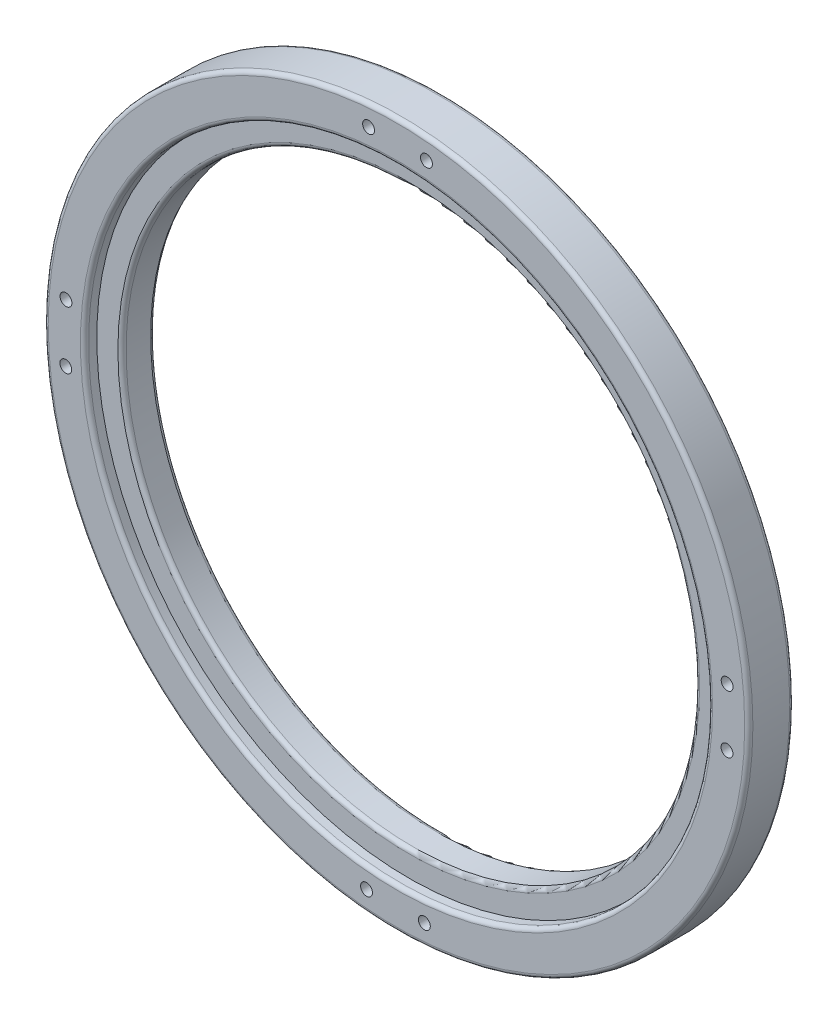
ISO-10303-21;
HEADER;
FILE_DESCRIPTION(('STEP AP214'),'2;1');
FILE_NAME('part.step','',(''),(''),'','','');
FILE_SCHEMA(('AUTOMOTIVE_DESIGN { 1 0 10303 214 1 1 1 1 }'));
ENDSEC;
DATA;
#1=APPLICATION_CONTEXT('core data for automotive mechanical design processes');
#2=APPLICATION_PROTOCOL_DEFINITION('international standard','automotive_design',2000,#1);
#3=PRODUCT_CONTEXT('',#1,'mechanical');
#4=PRODUCT('Part','Part','',(#3));
#5=PRODUCT_RELATED_PRODUCT_CATEGORY('part','',(#4));
#6=PRODUCT_DEFINITION_FORMATION('','',#4);
#7=PRODUCT_DEFINITION_CONTEXT('part definition',#1,'design');
#8=PRODUCT_DEFINITION('design','',#6,#7);
#9=PRODUCT_DEFINITION_SHAPE('','',#8);
#10=(LENGTH_UNIT() NAMED_UNIT(*) SI_UNIT(.MILLI.,.METRE.));
#11=(NAMED_UNIT(*) PLANE_ANGLE_UNIT() SI_UNIT($,.RADIAN.));
#12=(NAMED_UNIT(*) SI_UNIT($,.STERADIAN.) SOLID_ANGLE_UNIT());
#13=UNCERTAINTY_MEASURE_WITH_UNIT(LENGTH_MEASURE(1.E-05),#10,'distance_accuracy_value','');
#14=(GEOMETRIC_REPRESENTATION_CONTEXT(3) GLOBAL_UNCERTAINTY_ASSIGNED_CONTEXT((#13)) GLOBAL_UNIT_ASSIGNED_CONTEXT((#10,
#11,#12)) REPRESENTATION_CONTEXT('',''));
#15=CARTESIAN_POINT('',(0.,0.,0.));
#16=DIRECTION('',(0.,0.,1.));
#17=DIRECTION('',(1.,0.,0.));
#18=AXIS2_PLACEMENT_3D('',#15,#16,#17);
#19=CARTESIAN_POINT('',(0.,0.,8.));
#20=DIRECTION('',(0.,0.,1.));
#21=DIRECTION('',(1.,0.,0.));
#22=AXIS2_PLACEMENT_3D('',#19,#20,#21);
#23=PLANE('',#22);
#24=CARTESIAN_POINT('',(0.,0.,8.));
#25=DIRECTION('',(0.,0.,1.));
#26=DIRECTION('',(1.,0.,0.));
#27=AXIS2_PLACEMENT_3D('',#24,#25,#26);
#28=CIRCLE('',#27,71.);
#29=CARTESIAN_POINT('',(71.,0.,8.));
#30=VERTEX_POINT('',#29);
#31=EDGE_CURVE('E53',#30,#30,#28,.F.);
#32=ORIENTED_EDGE('',*,*,#31,.T.);
#33=EDGE_LOOP('',(#32));
#34=FACE_BOUND('',#33,.T.);
#35=CARTESIAN_POINT('',(0.,0.,8.));
#36=DIRECTION('',(0.,0.,1.));
#37=DIRECTION('',(1.,0.,0.));
#38=AXIS2_PLACEMENT_3D('',#35,#36,#37);
#39=CIRCLE('',#38,76.15);
#40=CARTESIAN_POINT('',(76.15,0.,8.));
#41=VERTEX_POINT('',#40);
#42=EDGE_CURVE('E93',#41,#41,#39,.T.);
#43=ORIENTED_EDGE('',*,*,#42,.T.);
#44=EDGE_LOOP('',(#43));
#45=FACE_BOUND('',#44,.T.);
#46=ADVANCED_FACE('F45',(#34,#45),#23,.T.);
#47=CARTESIAN_POINT('',(0.,0.,8.));
#48=DIRECTION('',(0.,0.,-1.));
#49=DIRECTION('',(-1.,0.,0.));
#50=AXIS2_PLACEMENT_3D('',#47,#48,#49);
#51=CYLINDRICAL_SURFACE('',#50,70.);
#52=CARTESIAN_POINT('',(0.,0.,1.));
#53=DIRECTION('',(0.,0.,1.));
#54=DIRECTION('',(1.,0.,0.));
#55=AXIS2_PLACEMENT_3D('',#52,#53,#54);
#56=CIRCLE('',#55,70.);
#57=CARTESIAN_POINT('',(70.,0.,1.));
#58=VERTEX_POINT('',#57);
#59=EDGE_CURVE('E77',#58,#58,#56,.F.);
#60=ORIENTED_EDGE('',*,*,#59,.T.);
#61=EDGE_LOOP('',(#60));
#62=FACE_BOUND('',#61,.T.);
#63=CARTESIAN_POINT('',(0.,0.,7.));
#64=DIRECTION('',(0.,0.,1.));
#65=DIRECTION('',(1.,0.,0.));
#66=AXIS2_PLACEMENT_3D('',#63,#64,#65);
#67=CIRCLE('',#66,70.);
#68=CARTESIAN_POINT('',(70.,0.,7.));
#69=VERTEX_POINT('',#68);
#70=EDGE_CURVE('E81',#69,#69,#67,.T.);
#71=ORIENTED_EDGE('',*,*,#70,.T.);
#72=EDGE_LOOP('',(#71));
#73=FACE_BOUND('',#72,.T.);
#74=ADVANCED_FACE('F229',(#62,#73),#51,.F.);
#75=CARTESIAN_POINT('',(0.,0.,8.));
#76=DIRECTION('',(0.,0.,-1.));
#77=DIRECTION('',(-1.,0.,0.));
#78=AXIS2_PLACEMENT_3D('',#75,#76,#77);
#79=CYLINDRICAL_SURFACE('',#78,86.);
#80=CARTESIAN_POINT('',(0.,0.,10.));
#81=DIRECTION('',(0.,0.,1.));
#82=DIRECTION('',(1.,0.,0.));
#83=AXIS2_PLACEMENT_3D('',#80,#81,#82);
#84=CIRCLE('',#83,86.);
#85=CARTESIAN_POINT('',(86.,0.,10.));
#86=VERTEX_POINT('',#85);
#87=EDGE_CURVE('E58',#86,#86,#84,.F.);
#88=ORIENTED_EDGE('',*,*,#87,.T.);
#89=EDGE_LOOP('',(#88));
#90=FACE_BOUND('',#89,.T.);
#91=CARTESIAN_POINT('',(0.,0.,1.));
#92=DIRECTION('',(0.,0.,1.));
#93=DIRECTION('',(1.,0.,0.));
#94=AXIS2_PLACEMENT_3D('',#91,#92,#93);
#95=CIRCLE('',#94,86.);
#96=CARTESIAN_POINT('',(86.,0.,1.));
#97=VERTEX_POINT('',#96);
#98=EDGE_CURVE('E63',#97,#97,#95,.T.);
#99=ORIENTED_EDGE('',*,*,#98,.T.);
#100=EDGE_LOOP('',(#99));
#101=FACE_BOUND('',#100,.T.);
#102=ADVANCED_FACE('F200',(#90,#101),#79,.T.);
#103=CARTESIAN_POINT('',(0.,0.,0.));
#104=DIRECTION('',(0.,0.,1.));
#105=DIRECTION('',(1.,0.,0.));
#106=AXIS2_PLACEMENT_3D('',#103,#104,#105);
#107=PLANE('',#106);
#108=CARTESIAN_POINT('',(-6.80811405362338,80.7133792071231,0.));
#109=DIRECTION('',(0.,0.,-1.));
#110=DIRECTION('',(-1.,0.,0.));
#111=AXIS2_PLACEMENT_3D('',#108,#109,#110);
#112=CIRCLE('',#111,1.475);
#113=CARTESIAN_POINT('',(-8.28311405362338,80.7133792071231,0.));
#114=VERTEX_POINT('',#113);
#115=EDGE_CURVE('E189',#114,#114,#112,.T.);
#116=ORIENTED_EDGE('',*,*,#115,.F.);
#117=EDGE_LOOP('',(#116));
#118=FACE_BOUND('',#117,.T.);
#119=CARTESIAN_POINT('',(7.31104770925723,80.6693782137495,0.));
#120=DIRECTION('',(0.,0.,-1.));
#121=DIRECTION('',(-1.,0.,0.));
#122=AXIS2_PLACEMENT_3D('',#119,#120,#121);
#123=CIRCLE('',#122,1.475);
#124=CARTESIAN_POINT('',(5.83604770925723,80.6693782137495,0.));
#125=VERTEX_POINT('',#124);
#126=EDGE_CURVE('E177',#125,#125,#123,.T.);
#127=ORIENTED_EDGE('',*,*,#126,.F.);
#128=EDGE_LOOP('',(#127));
#129=FACE_BOUND('',#128,.T.);
#130=CARTESIAN_POINT('',(-80.7133792071256,-6.80811405362128,0.));
#131=DIRECTION('',(0.,0.,-1.));
#132=DIRECTION('',(-1.,0.,0.));
#133=AXIS2_PLACEMENT_3D('',#130,#131,#132);
#134=CIRCLE('',#133,1.475);
#135=CARTESIAN_POINT('',(-82.1883792071256,-6.80811405362128,0.));
#136=VERTEX_POINT('',#135);
#137=EDGE_CURVE('E165',#136,#136,#134,.T.);
#138=ORIENTED_EDGE('',*,*,#137,.F.);
#139=EDGE_LOOP('',(#138));
#140=FACE_BOUND('',#139,.T.);
#141=CARTESIAN_POINT('',(-80.669378213752,7.3110477092593,0.));
#142=DIRECTION('',(0.,0.,-1.));
#143=DIRECTION('',(-1.,0.,0.));
#144=AXIS2_PLACEMENT_3D('',#141,#142,#143);
#145=CIRCLE('',#144,1.475);
#146=CARTESIAN_POINT('',(-82.144378213752,7.3110477092593,0.));
#147=VERTEX_POINT('',#146);
#148=EDGE_CURVE('E153',#147,#147,#145,.T.);
#149=ORIENTED_EDGE('',*,*,#148,.F.);
#150=EDGE_LOOP('',(#149));
#151=FACE_BOUND('',#150,.T.);
#152=CARTESIAN_POINT('',(6.8081140536188,-80.7133792071235,0.));
#153=DIRECTION('',(0.,0.,-1.));
#154=DIRECTION('',(-1.,0.,0.));
#155=AXIS2_PLACEMENT_3D('',#152,#153,#154);
#156=CIRCLE('',#155,1.475);
#157=CARTESIAN_POINT('',(5.3331140536188,-80.7133792071235,0.));
#158=VERTEX_POINT('',#157);
#159=EDGE_CURVE('E141',#158,#158,#156,.T.);
#160=ORIENTED_EDGE('',*,*,#159,.F.);
#161=EDGE_LOOP('',(#160));
#162=FACE_BOUND('',#161,.T.);
#163=CARTESIAN_POINT('',(-7.31104770926177,-80.6693782137499,0.));
#164=DIRECTION('',(0.,0.,-1.));
#165=DIRECTION('',(-1.,0.,0.));
#166=AXIS2_PLACEMENT_3D('',#163,#164,#165);
#167=CIRCLE('',#166,1.475);
#168=CARTESIAN_POINT('',(-8.78604770926177,-80.6693782137499,0.));
#169=VERTEX_POINT('',#168);
#170=EDGE_CURVE('E129',#169,#169,#167,.T.);
#171=ORIENTED_EDGE('',*,*,#170,.F.);
#172=EDGE_LOOP('',(#171));
#173=FACE_BOUND('',#172,.T.);
#174=CARTESIAN_POINT('',(80.7133792071211,6.80811405362087,0.));
#175=DIRECTION('',(0.,0.,-1.));
#176=DIRECTION('',(-1.,0.,0.));
#177=AXIS2_PLACEMENT_3D('',#174,#175,#176);
#178=CIRCLE('',#177,1.475);
#179=CARTESIAN_POINT('',(79.2383792071211,6.80811405362087,0.));
#180=VERTEX_POINT('',#179);
#181=EDGE_CURVE('E117',#180,#180,#178,.T.);
#182=ORIENTED_EDGE('',*,*,#181,.F.);
#183=EDGE_LOOP('',(#182));
#184=FACE_BOUND('',#183,.T.);
#185=CARTESIAN_POINT('',(80.6693782137475,-7.3110477092597,0.));
#186=DIRECTION('',(0.,0.,-1.));
#187=DIRECTION('',(-1.,0.,0.));
#188=AXIS2_PLACEMENT_3D('',#185,#186,#187);
#189=CIRCLE('',#188,1.475);
#190=CARTESIAN_POINT('',(79.1943782137475,-7.3110477092597,0.));
#191=VERTEX_POINT('',#190);
#192=EDGE_CURVE('E105',#191,#191,#189,.T.);
#193=ORIENTED_EDGE('',*,*,#192,.F.);
#194=EDGE_LOOP('',(#193));
#195=FACE_BOUND('',#194,.T.);
#196=CARTESIAN_POINT('',(0.,0.,0.));
#197=DIRECTION('',(0.,0.,1.));
#198=DIRECTION('',(1.,0.,0.));
#199=AXIS2_PLACEMENT_3D('',#196,#197,#198);
#200=CIRCLE('',#199,71.);
#201=CARTESIAN_POINT('',(71.,0.,0.));
#202=VERTEX_POINT('',#201);
#203=EDGE_CURVE('E85',#202,#202,#200,.T.);
#204=ORIENTED_EDGE('',*,*,#203,.T.);
#205=EDGE_LOOP('',(#204));
#206=FACE_BOUND('',#205,.T.);
#207=CARTESIAN_POINT('',(0.,0.,0.));
#208=DIRECTION('',(0.,0.,1.));
#209=DIRECTION('',(1.,0.,0.));
#210=AXIS2_PLACEMENT_3D('',#207,#208,#209);
#211=CIRCLE('',#210,85.);
#212=CARTESIAN_POINT('',(85.,0.,0.));
#213=VERTEX_POINT('',#212);
#214=EDGE_CURVE('E89',#213,#213,#211,.F.);
#215=ORIENTED_EDGE('',*,*,#214,.T.);
#216=EDGE_LOOP('',(#215));
#217=FACE_BOUND('',#216,.T.);
#218=ADVANCED_FACE('F196',(#118,#129,#140,#151,#162,#173,#184,#195,#206,#217),#107,.F.);
#219=CARTESIAN_POINT('',(0.,0.,11.));
#220=DIRECTION('',(0.,0.,1.));
#221=DIRECTION('',(1.,0.,0.));
#222=AXIS2_PLACEMENT_3D('',#219,#220,#221);
#223=PLANE('',#222);
#224=CARTESIAN_POINT('',(-6.80811405362338,80.7133792071231,11.));
#225=DIRECTION('',(0.,0.,-1.));
#226=DIRECTION('',(-1.,0.,0.));
#227=AXIS2_PLACEMENT_3D('',#224,#225,#226);
#228=CIRCLE('',#227,1.44999999999999);
#229=CARTESIAN_POINT('',(-8.25811405362338,80.7133792071231,11.));
#230=VERTEX_POINT('',#229);
#231=EDGE_CURVE('E181',#230,#230,#228,.T.);
#232=ORIENTED_EDGE('',*,*,#231,.T.);
#233=EDGE_LOOP('',(#232));
#234=FACE_BOUND('',#233,.T.);
#235=CARTESIAN_POINT('',(7.31104770925723,80.6693782137495,11.));
#236=DIRECTION('',(0.,0.,-1.));
#237=DIRECTION('',(-1.,0.,0.));
#238=AXIS2_PLACEMENT_3D('',#235,#236,#237);
#239=CIRCLE('',#238,1.44999999999999);
#240=CARTESIAN_POINT('',(5.86104770925724,80.6693782137495,11.));
#241=VERTEX_POINT('',#240);
#242=EDGE_CURVE('E169',#241,#241,#239,.T.);
#243=ORIENTED_EDGE('',*,*,#242,.T.);
#244=EDGE_LOOP('',(#243));
#245=FACE_BOUND('',#244,.T.);
#246=CARTESIAN_POINT('',(-80.7133792071256,-6.80811405362128,11.));
#247=DIRECTION('',(0.,0.,-1.));
#248=DIRECTION('',(-1.,0.,0.));
#249=AXIS2_PLACEMENT_3D('',#246,#247,#248);
#250=CIRCLE('',#249,1.44999999999999);
#251=CARTESIAN_POINT('',(-82.1633792071256,-6.80811405362128,11.));
#252=VERTEX_POINT('',#251);
#253=EDGE_CURVE('E157',#252,#252,#250,.T.);
#254=ORIENTED_EDGE('',*,*,#253,.T.);
#255=EDGE_LOOP('',(#254));
#256=FACE_BOUND('',#255,.T.);
#257=CARTESIAN_POINT('',(-80.669378213752,7.3110477092593,11.));
#258=DIRECTION('',(0.,0.,-1.));
#259=DIRECTION('',(-1.,0.,0.));
#260=AXIS2_PLACEMENT_3D('',#257,#258,#259);
#261=CIRCLE('',#260,1.44999999999999);
#262=CARTESIAN_POINT('',(-82.119378213752,7.3110477092593,11.));
#263=VERTEX_POINT('',#262);
#264=EDGE_CURVE('E145',#263,#263,#261,.T.);
#265=ORIENTED_EDGE('',*,*,#264,.T.);
#266=EDGE_LOOP('',(#265));
#267=FACE_BOUND('',#266,.T.);
#268=CARTESIAN_POINT('',(6.8081140536188,-80.7133792071235,11.));
#269=DIRECTION('',(0.,0.,-1.));
#270=DIRECTION('',(-1.,0.,0.));
#271=AXIS2_PLACEMENT_3D('',#268,#269,#270);
#272=CIRCLE('',#271,1.44999999999999);
#273=CARTESIAN_POINT('',(5.3581140536188,-80.7133792071235,11.));
#274=VERTEX_POINT('',#273);
#275=EDGE_CURVE('E133',#274,#274,#272,.T.);
#276=ORIENTED_EDGE('',*,*,#275,.T.);
#277=EDGE_LOOP('',(#276));
#278=FACE_BOUND('',#277,.T.);
#279=CARTESIAN_POINT('',(-7.31104770926177,-80.6693782137499,11.));
#280=DIRECTION('',(0.,0.,-1.));
#281=DIRECTION('',(-1.,0.,0.));
#282=AXIS2_PLACEMENT_3D('',#279,#280,#281);
#283=CIRCLE('',#282,1.44999999999999);
#284=CARTESIAN_POINT('',(-8.76104770926177,-80.6693782137499,11.));
#285=VERTEX_POINT('',#284);
#286=EDGE_CURVE('E121',#285,#285,#283,.T.);
#287=ORIENTED_EDGE('',*,*,#286,.T.);
#288=EDGE_LOOP('',(#287));
#289=FACE_BOUND('',#288,.T.);
#290=CARTESIAN_POINT('',(80.7133792071211,6.80811405362087,11.));
#291=DIRECTION('',(0.,0.,-1.));
#292=DIRECTION('',(-1.,0.,0.));
#293=AXIS2_PLACEMENT_3D('',#290,#291,#292);
#294=CIRCLE('',#293,1.44999999999999);
#295=CARTESIAN_POINT('',(79.2633792071211,6.80811405362087,11.));
#296=VERTEX_POINT('',#295);
#297=EDGE_CURVE('E109',#296,#296,#294,.T.);
#298=ORIENTED_EDGE('',*,*,#297,.T.);
#299=EDGE_LOOP('',(#298));
#300=FACE_BOUND('',#299,.T.);
#301=CARTESIAN_POINT('',(80.6693782137475,-7.3110477092597,11.));
#302=DIRECTION('',(0.,0.,-1.));
#303=DIRECTION('',(-1.,0.,0.));
#304=AXIS2_PLACEMENT_3D('',#301,#302,#303);
#305=CIRCLE('',#304,1.44999999999999);
#306=CARTESIAN_POINT('',(79.2193782137475,-7.3110477092597,11.));
#307=VERTEX_POINT('',#306);
#308=EDGE_CURVE('E97',#307,#307,#305,.T.);
#309=ORIENTED_EDGE('',*,*,#308,.T.);
#310=EDGE_LOOP('',(#309));
#311=FACE_BOUND('',#310,.T.);
#312=CARTESIAN_POINT('',(0.,0.,11.));
#313=DIRECTION('',(0.,0.,1.));
#314=DIRECTION('',(1.,0.,0.));
#315=AXIS2_PLACEMENT_3D('',#312,#313,#314);
#316=CIRCLE('',#315,85.);
#317=CARTESIAN_POINT('',(85.,0.,11.));
#318=VERTEX_POINT('',#317);
#319=EDGE_CURVE('E69',#318,#318,#316,.T.);
#320=ORIENTED_EDGE('',*,*,#319,.T.);
#321=EDGE_LOOP('',(#320));
#322=FACE_BOUND('',#321,.T.);
#323=CARTESIAN_POINT('',(0.,0.,11.));
#324=DIRECTION('',(0.,0.,1.));
#325=DIRECTION('',(1.,0.,0.));
#326=AXIS2_PLACEMENT_3D('',#323,#324,#325);
#327=CIRCLE('',#326,77.15);
#328=CARTESIAN_POINT('',(77.15,0.,11.));
#329=VERTEX_POINT('',#328);
#330=EDGE_CURVE('E73',#329,#329,#327,.F.);
#331=ORIENTED_EDGE('',*,*,#330,.T.);
#332=EDGE_LOOP('',(#331));
#333=FACE_BOUND('',#332,.T.);
#334=ADVANCED_FACE('F199',(#234,#245,#256,#267,#278,#289,#300,#311,#322,#333),#223,.T.);
#335=CARTESIAN_POINT('',(0.,0.,11.));
#336=DIRECTION('',(0.,0.,-1.));
#337=DIRECTION('',(-1.,0.,0.));
#338=AXIS2_PLACEMENT_3D('',#335,#336,#337);
#339=CYLINDRICAL_SURFACE('',#338,76.15);
#340=CARTESIAN_POINT('',(0.,0.,10.));
#341=DIRECTION('',(0.,0.,1.));
#342=DIRECTION('',(1.,0.,0.));
#343=AXIS2_PLACEMENT_3D('',#340,#341,#342);
#344=CIRCLE('',#343,76.15);
#345=CARTESIAN_POINT('',(76.15,0.,10.));
#346=VERTEX_POINT('',#345);
#347=EDGE_CURVE('E10',#346,#346,#344,.T.);
#348=ORIENTED_EDGE('',*,*,#347,.T.);
#349=EDGE_LOOP('',(#348));
#350=FACE_BOUND('',#349,.T.);
#351=ORIENTED_EDGE('',*,*,#42,.F.);
#352=EDGE_LOOP('',(#351));
#353=FACE_BOUND('',#352,.T.);
#354=ADVANCED_FACE('F246',(#350,#353),#339,.F.);
#355=CARTESIAN_POINT('',(0.,0.,1.));
#356=DIRECTION('',(0.,0.,1.));
#357=DIRECTION('',(1.,0.,0.));
#358=AXIS2_PLACEMENT_3D('',#355,#356,#357);
#359=TOROIDAL_SURFACE('',#358,71.,1.);
#360=ORIENTED_EDGE('',*,*,#59,.F.);
#361=EDGE_LOOP('',(#360));
#362=FACE_BOUND('',#361,.T.);
#363=ORIENTED_EDGE('',*,*,#203,.F.);
#364=EDGE_LOOP('',(#363));
#365=FACE_BOUND('',#364,.T.);
#366=ADVANCED_FACE('F249',(#362,#365),#359,.T.);
#367=CARTESIAN_POINT('',(0.,0.,10.));
#368=DIRECTION('',(0.,0.,1.));
#369=DIRECTION('',(1.,0.,0.));
#370=AXIS2_PLACEMENT_3D('',#367,#368,#369);
#371=TOROIDAL_SURFACE('',#370,85.,1.);
#372=ORIENTED_EDGE('',*,*,#87,.F.);
#373=EDGE_LOOP('',(#372));
#374=FACE_BOUND('',#373,.T.);
#375=ORIENTED_EDGE('',*,*,#319,.F.);
#376=EDGE_LOOP('',(#375));
#377=FACE_BOUND('',#376,.T.);
#378=ADVANCED_FACE('F224',(#374,#377),#371,.T.);
#379=CARTESIAN_POINT('',(0.,0.,1.));
#380=DIRECTION('',(0.,0.,1.));
#381=DIRECTION('',(1.,0.,0.));
#382=AXIS2_PLACEMENT_3D('',#379,#380,#381);
#383=TOROIDAL_SURFACE('',#382,85.,1.);
#384=ORIENTED_EDGE('',*,*,#214,.F.);
#385=EDGE_LOOP('',(#384));
#386=FACE_BOUND('',#385,.T.);
#387=ORIENTED_EDGE('',*,*,#98,.F.);
#388=EDGE_LOOP('',(#387));
#389=FACE_BOUND('',#388,.T.);
#390=ADVANCED_FACE('F220',(#386,#389),#383,.T.);
#391=CARTESIAN_POINT('',(0.,0.,7.));
#392=DIRECTION('',(0.,0.,1.));
#393=DIRECTION('',(1.,0.,0.));
#394=AXIS2_PLACEMENT_3D('',#391,#392,#393);
#395=TOROIDAL_SURFACE('',#394,71.,1.);
#396=ORIENTED_EDGE('',*,*,#31,.F.);
#397=EDGE_LOOP('',(#396));
#398=FACE_BOUND('',#397,.T.);
#399=ORIENTED_EDGE('',*,*,#70,.F.);
#400=EDGE_LOOP('',(#399));
#401=FACE_BOUND('',#400,.T.);
#402=ADVANCED_FACE('F223',(#398,#401),#395,.T.);
#403=CARTESIAN_POINT('',(0.,0.,10.));
#404=DIRECTION('',(0.,0.,1.));
#405=DIRECTION('',(1.,0.,0.));
#406=AXIS2_PLACEMENT_3D('',#403,#404,#405);
#407=TOROIDAL_SURFACE('',#406,77.15,1.);
#408=ORIENTED_EDGE('',*,*,#330,.F.);
#409=EDGE_LOOP('',(#408));
#410=FACE_BOUND('',#409,.T.);
#411=ORIENTED_EDGE('',*,*,#347,.F.);
#412=EDGE_LOOP('',(#411));
#413=FACE_BOUND('',#412,.T.);
#414=ADVANCED_FACE('F47',(#410,#413),#407,.T.);
#415=CARTESIAN_POINT('',(80.6693782137475,-7.3110477092597,0.));
#416=DIRECTION('',(0.,0.,-1.));
#417=DIRECTION('',(-1.,0.,0.));
#418=AXIS2_PLACEMENT_3D('',#415,#416,#417);
#419=CYLINDRICAL_SURFACE('',#418,1.44999999999999);
#420=ORIENTED_EDGE('',*,*,#308,.F.);
#421=EDGE_LOOP('',(#420));
#422=FACE_BOUND('',#421,.T.);
#423=CARTESIAN_POINT('',(80.6693782137475,-7.3110477092597,0.0250000000000042));
#424=DIRECTION('',(0.,0.,-1.));
#425=DIRECTION('',(-1.,0.,0.));
#426=AXIS2_PLACEMENT_3D('',#423,#424,#425);
#427=CIRCLE('',#426,1.44999999999999);
#428=CARTESIAN_POINT('',(79.2193782137475,-7.3110477092597,0.0250000000000042));
#429=VERTEX_POINT('',#428);
#430=EDGE_CURVE('E101',#429,#429,#427,.T.);
#431=ORIENTED_EDGE('',*,*,#430,.T.);
#432=EDGE_LOOP('',(#431));
#433=FACE_BOUND('',#432,.T.);
#434=ADVANCED_FACE('F250',(#422,#433),#419,.F.);
#435=CARTESIAN_POINT('',(80.6693782137475,-7.3110477092597,0.));
#436=DIRECTION('',(0.,0.,-1.));
#437=DIRECTION('',(-1.,0.,0.));
#438=AXIS2_PLACEMENT_3D('',#435,#436,#437);
#439=CONICAL_SURFACE('',#438,1.475,0.785398163397587);
#440=ORIENTED_EDGE('',*,*,#430,.F.);
#441=EDGE_LOOP('',(#440));
#442=FACE_BOUND('',#441,.T.);
#443=ORIENTED_EDGE('',*,*,#192,.T.);
#444=EDGE_LOOP('',(#443));
#445=FACE_BOUND('',#444,.T.);
#446=ADVANCED_FACE('F253',(#442,#445),#439,.F.);
#447=CARTESIAN_POINT('',(80.7133792071211,6.80811405362087,0.));
#448=DIRECTION('',(0.,0.,-1.));
#449=DIRECTION('',(-1.,0.,0.));
#450=AXIS2_PLACEMENT_3D('',#447,#448,#449);
#451=CYLINDRICAL_SURFACE('',#450,1.44999999999999);
#452=ORIENTED_EDGE('',*,*,#297,.F.);
#453=EDGE_LOOP('',(#452));
#454=FACE_BOUND('',#453,.T.);
#455=CARTESIAN_POINT('',(80.7133792071211,6.80811405362087,0.0250000000000042));
#456=DIRECTION('',(0.,0.,-1.));
#457=DIRECTION('',(-1.,0.,0.));
#458=AXIS2_PLACEMENT_3D('',#455,#456,#457);
#459=CIRCLE('',#458,1.44999999999999);
#460=CARTESIAN_POINT('',(79.2633792071211,6.80811405362087,0.0250000000000042));
#461=VERTEX_POINT('',#460);
#462=EDGE_CURVE('E113',#461,#461,#459,.T.);
#463=ORIENTED_EDGE('',*,*,#462,.T.);
#464=EDGE_LOOP('',(#463));
#465=FACE_BOUND('',#464,.T.);
#466=ADVANCED_FACE('F257',(#454,#465),#451,.F.);
#467=CARTESIAN_POINT('',(80.7133792071211,6.80811405362087,0.));
#468=DIRECTION('',(0.,0.,-1.));
#469=DIRECTION('',(-1.,0.,0.));
#470=AXIS2_PLACEMENT_3D('',#467,#468,#469);
#471=CONICAL_SURFACE('',#470,1.475,0.785398163397587);
#472=ORIENTED_EDGE('',*,*,#462,.F.);
#473=EDGE_LOOP('',(#472));
#474=FACE_BOUND('',#473,.T.);
#475=ORIENTED_EDGE('',*,*,#181,.T.);
#476=EDGE_LOOP('',(#475));
#477=FACE_BOUND('',#476,.T.);
#478=ADVANCED_FACE('F261',(#474,#477),#471,.F.);
#479=CARTESIAN_POINT('',(-7.31104770926177,-80.6693782137499,0.));
#480=DIRECTION('',(0.,0.,-1.));
#481=DIRECTION('',(-1.,0.,0.));
#482=AXIS2_PLACEMENT_3D('',#479,#480,#481);
#483=CYLINDRICAL_SURFACE('',#482,1.44999999999999);
#484=ORIENTED_EDGE('',*,*,#286,.F.);
#485=EDGE_LOOP('',(#484));
#486=FACE_BOUND('',#485,.T.);
#487=CARTESIAN_POINT('',(-7.31104770926177,-80.6693782137499,0.0250000000000042));
#488=DIRECTION('',(0.,0.,-1.));
#489=DIRECTION('',(-1.,0.,0.));
#490=AXIS2_PLACEMENT_3D('',#487,#488,#489);
#491=CIRCLE('',#490,1.45);
#492=CARTESIAN_POINT('',(-8.76104770926177,-80.6693782137499,0.0250000000000042));
#493=VERTEX_POINT('',#492);
#494=EDGE_CURVE('E125',#493,#493,#491,.T.);
#495=ORIENTED_EDGE('',*,*,#494,.T.);
#496=EDGE_LOOP('',(#495));
#497=FACE_BOUND('',#496,.T.);
#498=ADVANCED_FACE('F265',(#486,#497),#483,.F.);
#499=CARTESIAN_POINT('',(-7.31104770926177,-80.6693782137499,0.));
#500=DIRECTION('',(0.,0.,-1.));
#501=DIRECTION('',(-1.,0.,0.));
#502=AXIS2_PLACEMENT_3D('',#499,#500,#501);
#503=CONICAL_SURFACE('',#502,1.475,0.785398163397466);
#504=ORIENTED_EDGE('',*,*,#494,.F.);
#505=EDGE_LOOP('',(#504));
#506=FACE_BOUND('',#505,.T.);
#507=ORIENTED_EDGE('',*,*,#170,.T.);
#508=EDGE_LOOP('',(#507));
#509=FACE_BOUND('',#508,.T.);
#510=ADVANCED_FACE('F269',(#506,#509),#503,.F.);
#511=CARTESIAN_POINT('',(6.8081140536188,-80.7133792071235,0.));
#512=DIRECTION('',(0.,0.,-1.));
#513=DIRECTION('',(-1.,0.,0.));
#514=AXIS2_PLACEMENT_3D('',#511,#512,#513);
#515=CYLINDRICAL_SURFACE('',#514,1.44999999999999);
#516=ORIENTED_EDGE('',*,*,#275,.F.);
#517=EDGE_LOOP('',(#516));
#518=FACE_BOUND('',#517,.T.);
#519=CARTESIAN_POINT('',(6.8081140536188,-80.7133792071235,0.0250000000000042));
#520=DIRECTION('',(0.,0.,-1.));
#521=DIRECTION('',(-1.,0.,0.));
#522=AXIS2_PLACEMENT_3D('',#519,#520,#521);
#523=CIRCLE('',#522,1.45);
#524=CARTESIAN_POINT('',(5.3581140536188,-80.7133792071235,0.0250000000000042));
#525=VERTEX_POINT('',#524);
#526=EDGE_CURVE('E137',#525,#525,#523,.T.);
#527=ORIENTED_EDGE('',*,*,#526,.T.);
#528=EDGE_LOOP('',(#527));
#529=FACE_BOUND('',#528,.T.);
#530=ADVANCED_FACE('F273',(#518,#529),#515,.F.);
#531=CARTESIAN_POINT('',(6.8081140536188,-80.7133792071235,0.));
#532=DIRECTION('',(0.,0.,-1.));
#533=DIRECTION('',(-1.,0.,0.));
#534=AXIS2_PLACEMENT_3D('',#531,#532,#533);
#535=CONICAL_SURFACE('',#534,1.475,0.785398163397448);
#536=ORIENTED_EDGE('',*,*,#526,.F.);
#537=EDGE_LOOP('',(#536));
#538=FACE_BOUND('',#537,.T.);
#539=ORIENTED_EDGE('',*,*,#159,.T.);
#540=EDGE_LOOP('',(#539));
#541=FACE_BOUND('',#540,.T.);
#542=ADVANCED_FACE('F277',(#538,#541),#535,.F.);
#543=CARTESIAN_POINT('',(-80.669378213752,7.3110477092593,0.));
#544=DIRECTION('',(0.,0.,-1.));
#545=DIRECTION('',(-1.,0.,0.));
#546=AXIS2_PLACEMENT_3D('',#543,#544,#545);
#547=CYLINDRICAL_SURFACE('',#546,1.44999999999999);
#548=ORIENTED_EDGE('',*,*,#264,.F.);
#549=EDGE_LOOP('',(#548));
#550=FACE_BOUND('',#549,.T.);
#551=CARTESIAN_POINT('',(-80.669378213752,7.3110477092593,0.0250000000000042));
#552=DIRECTION('',(0.,0.,-1.));
#553=DIRECTION('',(-1.,0.,0.));
#554=AXIS2_PLACEMENT_3D('',#551,#552,#553);
#555=CIRCLE('',#554,1.44999999999999);
#556=CARTESIAN_POINT('',(-82.119378213752,7.3110477092593,0.0250000000000042));
#557=VERTEX_POINT('',#556);
#558=EDGE_CURVE('E149',#557,#557,#555,.T.);
#559=ORIENTED_EDGE('',*,*,#558,.T.);
#560=EDGE_LOOP('',(#559));
#561=FACE_BOUND('',#560,.T.);
#562=ADVANCED_FACE('F281',(#550,#561),#547,.F.);
#563=CARTESIAN_POINT('',(-80.669378213752,7.3110477092593,0.));
#564=DIRECTION('',(0.,0.,-1.));
#565=DIRECTION('',(-1.,0.,0.));
#566=AXIS2_PLACEMENT_3D('',#563,#564,#565);
#567=CONICAL_SURFACE('',#566,1.475,0.785398163397587);
#568=ORIENTED_EDGE('',*,*,#558,.F.);
#569=EDGE_LOOP('',(#568));
#570=FACE_BOUND('',#569,.T.);
#571=ORIENTED_EDGE('',*,*,#148,.T.);
#572=EDGE_LOOP('',(#571));
#573=FACE_BOUND('',#572,.T.);
#574=ADVANCED_FACE('F285',(#570,#573),#567,.F.);
#575=CARTESIAN_POINT('',(-80.7133792071256,-6.80811405362128,0.));
#576=DIRECTION('',(0.,0.,-1.));
#577=DIRECTION('',(-1.,0.,0.));
#578=AXIS2_PLACEMENT_3D('',#575,#576,#577);
#579=CYLINDRICAL_SURFACE('',#578,1.44999999999999);
#580=ORIENTED_EDGE('',*,*,#253,.F.);
#581=EDGE_LOOP('',(#580));
#582=FACE_BOUND('',#581,.T.);
#583=CARTESIAN_POINT('',(-80.7133792071256,-6.80811405362128,0.0250000000000042));
#584=DIRECTION('',(0.,0.,-1.));
#585=DIRECTION('',(-1.,0.,0.));
#586=AXIS2_PLACEMENT_3D('',#583,#584,#585);
#587=CIRCLE('',#586,1.44999999999999);
#588=CARTESIAN_POINT('',(-82.1633792071256,-6.80811405362128,0.0250000000000042));
#589=VERTEX_POINT('',#588);
#590=EDGE_CURVE('E161',#589,#589,#587,.T.);
#591=ORIENTED_EDGE('',*,*,#590,.T.);
#592=EDGE_LOOP('',(#591));
#593=FACE_BOUND('',#592,.T.);
#594=ADVANCED_FACE('F289',(#582,#593),#579,.F.);
#595=CARTESIAN_POINT('',(-80.7133792071256,-6.80811405362128,0.));
#596=DIRECTION('',(0.,0.,-1.));
#597=DIRECTION('',(-1.,0.,0.));
#598=AXIS2_PLACEMENT_3D('',#595,#596,#597);
#599=CONICAL_SURFACE('',#598,1.475,0.785398163397587);
#600=ORIENTED_EDGE('',*,*,#590,.F.);
#601=EDGE_LOOP('',(#600));
#602=FACE_BOUND('',#601,.T.);
#603=ORIENTED_EDGE('',*,*,#137,.T.);
#604=EDGE_LOOP('',(#603));
#605=FACE_BOUND('',#604,.T.);
#606=ADVANCED_FACE('F293',(#602,#605),#599,.F.);
#607=CARTESIAN_POINT('',(7.31104770925723,80.6693782137495,0.));
#608=DIRECTION('',(0.,0.,-1.));
#609=DIRECTION('',(-1.,0.,0.));
#610=AXIS2_PLACEMENT_3D('',#607,#608,#609);
#611=CYLINDRICAL_SURFACE('',#610,1.44999999999999);
#612=ORIENTED_EDGE('',*,*,#242,.F.);
#613=EDGE_LOOP('',(#612));
#614=FACE_BOUND('',#613,.T.);
#615=CARTESIAN_POINT('',(7.31104770925723,80.6693782137495,0.0250000000000042));
#616=DIRECTION('',(0.,0.,-1.));
#617=DIRECTION('',(-1.,0.,0.));
#618=AXIS2_PLACEMENT_3D('',#615,#616,#617);
#619=CIRCLE('',#618,1.45);
#620=CARTESIAN_POINT('',(5.86104770925724,80.6693782137495,0.0250000000000042));
#621=VERTEX_POINT('',#620);
#622=EDGE_CURVE('E173',#621,#621,#619,.T.);
#623=ORIENTED_EDGE('',*,*,#622,.T.);
#624=EDGE_LOOP('',(#623));
#625=FACE_BOUND('',#624,.T.);
#626=ADVANCED_FACE('F297',(#614,#625),#611,.F.);
#627=CARTESIAN_POINT('',(7.31104770925723,80.6693782137495,0.));
#628=DIRECTION('',(0.,0.,-1.));
#629=DIRECTION('',(-1.,0.,0.));
#630=AXIS2_PLACEMENT_3D('',#627,#628,#629);
#631=CONICAL_SURFACE('',#630,1.475,0.785398163397448);
#632=ORIENTED_EDGE('',*,*,#622,.F.);
#633=EDGE_LOOP('',(#632));
#634=FACE_BOUND('',#633,.T.);
#635=ORIENTED_EDGE('',*,*,#126,.T.);
#636=EDGE_LOOP('',(#635));
#637=FACE_BOUND('',#636,.T.);
#638=ADVANCED_FACE('F301',(#634,#637),#631,.F.);
#639=CARTESIAN_POINT('',(-6.80811405362338,80.7133792071231,0.));
#640=DIRECTION('',(0.,0.,-1.));
#641=DIRECTION('',(-1.,0.,0.));
#642=AXIS2_PLACEMENT_3D('',#639,#640,#641);
#643=CYLINDRICAL_SURFACE('',#642,1.44999999999999);
#644=ORIENTED_EDGE('',*,*,#231,.F.);
#645=EDGE_LOOP('',(#644));
#646=FACE_BOUND('',#645,.T.);
#647=CARTESIAN_POINT('',(-6.80811405362338,80.7133792071231,0.0250000000000042));
#648=DIRECTION('',(0.,0.,-1.));
#649=DIRECTION('',(-1.,0.,0.));
#650=AXIS2_PLACEMENT_3D('',#647,#648,#649);
#651=CIRCLE('',#650,1.45);
#652=CARTESIAN_POINT('',(-8.25811405362338,80.7133792071231,0.0250000000000042));
#653=VERTEX_POINT('',#652);
#654=EDGE_CURVE('E185',#653,#653,#651,.T.);
#655=ORIENTED_EDGE('',*,*,#654,.T.);
#656=EDGE_LOOP('',(#655));
#657=FACE_BOUND('',#656,.T.);
#658=ADVANCED_FACE('F305',(#646,#657),#643,.F.);
#659=CARTESIAN_POINT('',(-6.80811405362338,80.7133792071231,0.));
#660=DIRECTION('',(0.,0.,-1.));
#661=DIRECTION('',(-1.,0.,0.));
#662=AXIS2_PLACEMENT_3D('',#659,#660,#661);
#663=CONICAL_SURFACE('',#662,1.475,0.785398163397448);
#664=ORIENTED_EDGE('',*,*,#654,.F.);
#665=EDGE_LOOP('',(#664));
#666=FACE_BOUND('',#665,.T.);
#667=ORIENTED_EDGE('',*,*,#115,.T.);
#668=EDGE_LOOP('',(#667));
#669=FACE_BOUND('',#668,.T.);
#670=ADVANCED_FACE('F194',(#666,#669),#663,.F.);
#671=CLOSED_SHELL('',(#46,#74,#102,#218,#334,#354,#366,#378,#390,#402,#414,#434,#446,#466,#478,
#498,#510,#530,#542,#562,#574,#594,#606,#626,#638,#658,#670));
#672=MANIFOLD_SOLID_BREP('B2',#671);
#673=ADVANCED_BREP_SHAPE_REPRESENTATION('',(#18,#672),#14);
#674=SHAPE_DEFINITION_REPRESENTATION(#9,#673);
ENDSEC;
END-ISO-10303-21;
